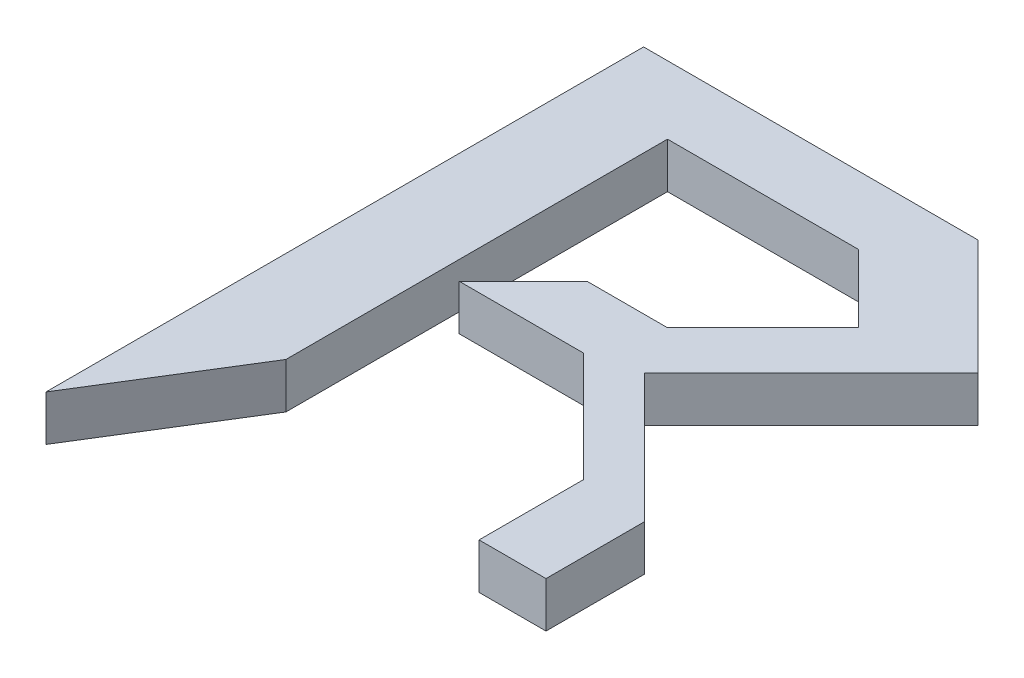
ISO-10303-21;
HEADER;
FILE_DESCRIPTION(('STEP AP214'),'2;1');
FILE_NAME('part.step','',(''),(''),'','','');
FILE_SCHEMA(('AUTOMOTIVE_DESIGN { 1 0 10303 214 1 1 1 1 }'));
ENDSEC;
DATA;
#1=APPLICATION_CONTEXT('core data for automotive mechanical design processes');
#2=APPLICATION_PROTOCOL_DEFINITION('international standard','automotive_design',2000,#1);
#3=PRODUCT_CONTEXT('',#1,'mechanical');
#4=PRODUCT('Part','Part','',(#3));
#5=PRODUCT_RELATED_PRODUCT_CATEGORY('part','',(#4));
#6=PRODUCT_DEFINITION_FORMATION('','',#4);
#7=PRODUCT_DEFINITION_CONTEXT('part definition',#1,'design');
#8=PRODUCT_DEFINITION('design','',#6,#7);
#9=PRODUCT_DEFINITION_SHAPE('','',#8);
#10=(LENGTH_UNIT() NAMED_UNIT(*) SI_UNIT(.MILLI.,.METRE.));
#11=(NAMED_UNIT(*) PLANE_ANGLE_UNIT() SI_UNIT($,.RADIAN.));
#12=(NAMED_UNIT(*) SI_UNIT($,.STERADIAN.) SOLID_ANGLE_UNIT());
#13=UNCERTAINTY_MEASURE_WITH_UNIT(LENGTH_MEASURE(1.E-05),#10,'distance_accuracy_value','');
#14=(GEOMETRIC_REPRESENTATION_CONTEXT(3) GLOBAL_UNCERTAINTY_ASSIGNED_CONTEXT((#13)) GLOBAL_UNIT_ASSIGNED_CONTEXT((#10,
#11,#12)) REPRESENTATION_CONTEXT('',''));
#15=CARTESIAN_POINT('',(0.,0.,0.));
#16=DIRECTION('',(0.,0.,1.));
#17=DIRECTION('',(1.,0.,0.));
#18=AXIS2_PLACEMENT_3D('',#15,#16,#17);
#19=CARTESIAN_POINT('',(-308.734454598416,5.,-184.527009345045));
#20=DIRECTION('',(0.,0.,1.));
#21=DIRECTION('',(1.,0.,0.));
#22=AXIS2_PLACEMENT_3D('',#19,#20,#21);
#23=PLANE('',#22);
#24=DIRECTION('',(-1.,0.,0.));
#25=VECTOR('',#24,1.);
#26=CARTESIAN_POINT('',(-308.734454598416,0.,-184.527009345045));
#27=LINE('',#26,#25);
#28=CARTESIAN_POINT('',(-308.734454598416,0.,-184.527009345045));
#29=VERTEX_POINT('',#28);
#30=CARTESIAN_POINT('',(-329.704801731719,0.,-184.527009345045));
#31=VERTEX_POINT('',#30);
#32=EDGE_CURVE('E184',#29,#31,#27,.T.);
#33=ORIENTED_EDGE('',*,*,#32,.F.);
#34=DIRECTION('',(0.,-1.,0.));
#35=VECTOR('',#34,1.);
#36=CARTESIAN_POINT('',(-308.734454598416,5.,-184.527009345045));
#37=LINE('',#36,#35);
#38=CARTESIAN_POINT('',(-308.734454598416,5.,-184.527009345045));
#39=VERTEX_POINT('',#38);
#40=EDGE_CURVE('E11',#39,#29,#37,.T.);
#41=ORIENTED_EDGE('',*,*,#40,.F.);
#42=DIRECTION('',(-1.,0.,0.));
#43=VECTOR('',#42,1.);
#44=CARTESIAN_POINT('',(-308.734454598416,5.,-184.527009345045));
#45=LINE('',#44,#43);
#46=CARTESIAN_POINT('',(-329.704801731719,5.,-184.527009345045));
#47=VERTEX_POINT('',#46);
#48=EDGE_CURVE('E231',#39,#47,#45,.T.);
#49=ORIENTED_EDGE('',*,*,#48,.T.);
#50=DIRECTION('',(0.,-1.,0.));
#51=VECTOR('',#50,1.);
#52=CARTESIAN_POINT('',(-329.704801731719,5.,-184.527009345045));
#53=LINE('',#52,#51);
#54=EDGE_CURVE('E36',#47,#31,#53,.T.);
#55=ORIENTED_EDGE('',*,*,#54,.T.);
#56=EDGE_LOOP('',(#33,#41,#49,#55));
#57=FACE_BOUND('',#56,.T.);
#58=ADVANCED_FACE('F33',(#57),#23,.T.);
#59=CARTESIAN_POINT('',(-301.268571849387,5.,-177.061126596016));
#60=DIRECTION('',(-0.70710678118654,0.,0.707106781186555));
#61=DIRECTION('',(0.707106781186555,0.,0.70710678118654));
#62=AXIS2_PLACEMENT_3D('',#59,#60,#61);
#63=PLANE('',#62);
#64=DIRECTION('',(-0.707106781186555,0.,-0.70710678118654));
#65=VECTOR('',#64,1.);
#66=CARTESIAN_POINT('',(-301.268571849387,0.,-177.061126596016));
#67=LINE('',#66,#65);
#68=CARTESIAN_POINT('',(-301.268571849387,0.,-177.061126596016));
#69=VERTEX_POINT('',#68);
#70=EDGE_CURVE('E229',#69,#29,#67,.T.);
#71=ORIENTED_EDGE('',*,*,#70,.F.);
#72=DIRECTION('',(0.,-1.,0.));
#73=VECTOR('',#72,1.);
#74=CARTESIAN_POINT('',(-301.268571849387,5.,-177.061126596016));
#75=LINE('',#74,#73);
#76=CARTESIAN_POINT('',(-301.268571849387,5.,-177.061126596016));
#77=VERTEX_POINT('',#76);
#78=EDGE_CURVE('E42',#77,#69,#75,.T.);
#79=ORIENTED_EDGE('',*,*,#78,.F.);
#80=DIRECTION('',(-0.707106781186555,0.,-0.70710678118654));
#81=VECTOR('',#80,1.);
#82=CARTESIAN_POINT('',(-301.268571849387,5.,-177.061126596016));
#83=LINE('',#82,#81);
#84=EDGE_CURVE('E174',#77,#39,#83,.T.);
#85=ORIENTED_EDGE('',*,*,#84,.T.);
#86=ORIENTED_EDGE('',*,*,#40,.T.);
#87=EDGE_LOOP('',(#71,#79,#85,#86));
#88=FACE_BOUND('',#87,.T.);
#89=ADVANCED_FACE('F261',(#88),#63,.T.);
#90=CARTESIAN_POINT('',(-311.753745416038,5.,-166.575953029364));
#91=DIRECTION('',(-0.707106781186556,0.,-0.707106781186539));
#92=DIRECTION('',(-0.707106781186539,0.,0.707106781186556));
#93=AXIS2_PLACEMENT_3D('',#90,#91,#92);
#94=PLANE('',#93);
#95=DIRECTION('',(0.707106781186539,0.,-0.707106781186556));
#96=VECTOR('',#95,1.);
#97=CARTESIAN_POINT('',(-311.753745416038,0.,-166.575953029364));
#98=LINE('',#97,#96);
#99=CARTESIAN_POINT('',(-311.753745416038,0.,-166.575953029364));
#100=VERTEX_POINT('',#99);
#101=EDGE_CURVE('E161',#100,#69,#98,.T.);
#102=ORIENTED_EDGE('',*,*,#101,.F.);
#103=DIRECTION('',(0.,-1.,0.));
#104=VECTOR('',#103,1.);
#105=CARTESIAN_POINT('',(-311.753745416038,5.,-166.575953029364));
#106=LINE('',#105,#104);
#107=CARTESIAN_POINT('',(-311.753745416038,5.,-166.575953029364));
#108=VERTEX_POINT('',#107);
#109=EDGE_CURVE('E156',#108,#100,#106,.T.);
#110=ORIENTED_EDGE('',*,*,#109,.F.);
#111=DIRECTION('',(0.707106781186539,0.,-0.707106781186556));
#112=VECTOR('',#111,1.);
#113=CARTESIAN_POINT('',(-311.753745416038,5.,-166.575953029364));
#114=LINE('',#113,#112);
#115=EDGE_CURVE('E159',#108,#77,#114,.T.);
#116=ORIENTED_EDGE('',*,*,#115,.T.);
#117=ORIENTED_EDGE('',*,*,#78,.T.);
#118=EDGE_LOOP('',(#102,#110,#116,#117));
#119=FACE_BOUND('',#118,.T.);
#120=ADVANCED_FACE('F158',(#119),#94,.T.);
#121=CARTESIAN_POINT('',(-320.592033082169,5.,-166.575953029364));
#122=DIRECTION('',(0.,0.,-1.));
#123=DIRECTION('',(-1.,0.,0.));
#124=AXIS2_PLACEMENT_3D('',#121,#122,#123);
#125=PLANE('',#124);
#126=DIRECTION('',(1.,0.,0.));
#127=VECTOR('',#126,1.);
#128=CARTESIAN_POINT('',(-320.592033082169,0.,-166.575953029364));
#129=LINE('',#128,#127);
#130=CARTESIAN_POINT('',(-320.592033082169,0.,-166.575953029364));
#131=VERTEX_POINT('',#130);
#132=EDGE_CURVE('E226',#131,#100,#129,.T.);
#133=ORIENTED_EDGE('',*,*,#132,.F.);
#134=DIRECTION('',(0.,-1.,0.));
#135=VECTOR('',#134,1.);
#136=CARTESIAN_POINT('',(-320.592033082169,5.,-166.575953029364));
#137=LINE('',#136,#135);
#138=CARTESIAN_POINT('',(-320.592033082169,5.,-166.575953029364));
#139=VERTEX_POINT('',#138);
#140=EDGE_CURVE('E166',#139,#131,#137,.T.);
#141=ORIENTED_EDGE('',*,*,#140,.F.);
#142=DIRECTION('',(1.,0.,0.));
#143=VECTOR('',#142,1.);
#144=CARTESIAN_POINT('',(-320.592033082169,5.,-166.575953029364));
#145=LINE('',#144,#143);
#146=EDGE_CURVE('E172',#139,#108,#145,.T.);
#147=ORIENTED_EDGE('',*,*,#146,.T.);
#148=ORIENTED_EDGE('',*,*,#109,.T.);
#149=EDGE_LOOP('',(#133,#141,#147,#148));
#150=FACE_BOUND('',#149,.T.);
#151=ADVANCED_FACE('F176',(#150),#125,.T.);
#152=CARTESIAN_POINT('',(-327.618746257726,5.,-159.549239853807));
#153=DIRECTION('',(-0.707106781186556,0.,-0.707106781186539));
#154=DIRECTION('',(-0.707106781186539,0.,0.707106781186556));
#155=AXIS2_PLACEMENT_3D('',#152,#153,#154);
#156=PLANE('',#155);
#157=DIRECTION('',(0.707106781186539,0.,-0.707106781186556));
#158=VECTOR('',#157,1.);
#159=CARTESIAN_POINT('',(-327.618746257726,0.,-159.549239853807));
#160=LINE('',#159,#158);
#161=CARTESIAN_POINT('',(-327.618746257726,0.,-159.549239853807));
#162=VERTEX_POINT('',#161);
#163=EDGE_CURVE('E223',#162,#131,#160,.T.);
#164=ORIENTED_EDGE('',*,*,#163,.F.);
#165=DIRECTION('',(0.,-1.,0.));
#166=VECTOR('',#165,1.);
#167=CARTESIAN_POINT('',(-327.618746257726,5.,-159.549239853807));
#168=LINE('',#167,#166);
#169=CARTESIAN_POINT('',(-327.618746257726,5.,-159.549239853807));
#170=VERTEX_POINT('',#169);
#171=EDGE_CURVE('E235',#170,#162,#168,.T.);
#172=ORIENTED_EDGE('',*,*,#171,.F.);
#173=DIRECTION('',(0.707106781186539,0.,-0.707106781186556));
#174=VECTOR('',#173,1.);
#175=CARTESIAN_POINT('',(-327.618746257726,5.,-159.549239853807));
#176=LINE('',#175,#174);
#177=EDGE_CURVE('E177',#170,#139,#176,.T.);
#178=ORIENTED_EDGE('',*,*,#177,.T.);
#179=ORIENTED_EDGE('',*,*,#140,.T.);
#180=EDGE_LOOP('',(#164,#172,#178,#179));
#181=FACE_BOUND('',#180,.T.);
#182=ADVANCED_FACE('F274',(#181),#156,.T.);
#183=CARTESIAN_POINT('',(-313.959793180223,5.,-159.549239853807));
#184=DIRECTION('',(0.,0.,1.));
#185=DIRECTION('',(1.,0.,0.));
#186=AXIS2_PLACEMENT_3D('',#183,#184,#185);
#187=PLANE('',#186);
#188=DIRECTION('',(-1.,0.,0.));
#189=VECTOR('',#188,1.);
#190=CARTESIAN_POINT('',(-313.959793180223,0.,-159.549239853807));
#191=LINE('',#190,#189);
#192=CARTESIAN_POINT('',(-313.959793180223,0.,-159.549239853807));
#193=VERTEX_POINT('',#192);
#194=EDGE_CURVE('E220',#193,#162,#191,.T.);
#195=ORIENTED_EDGE('',*,*,#194,.F.);
#196=DIRECTION('',(0.,-1.,0.));
#197=VECTOR('',#196,1.);
#198=CARTESIAN_POINT('',(-313.959793180223,5.,-159.549239853807));
#199=LINE('',#198,#197);
#200=CARTESIAN_POINT('',(-313.959793180223,5.,-159.549239853807));
#201=VERTEX_POINT('',#200);
#202=EDGE_CURVE('E237',#201,#193,#199,.T.);
#203=ORIENTED_EDGE('',*,*,#202,.F.);
#204=DIRECTION('',(-1.,0.,0.));
#205=VECTOR('',#204,1.);
#206=CARTESIAN_POINT('',(-313.959793180223,5.,-159.549239853807));
#207=LINE('',#206,#205);
#208=EDGE_CURVE('E179',#201,#170,#207,.T.);
#209=ORIENTED_EDGE('',*,*,#208,.T.);
#210=ORIENTED_EDGE('',*,*,#171,.T.);
#211=EDGE_LOOP('',(#195,#203,#209,#210));
#212=FACE_BOUND('',#211,.T.);
#213=ADVANCED_FACE('F277',(#212),#187,.T.);
#214=CARTESIAN_POINT('',(-301.910980799023,5.,-147.500427472607));
#215=DIRECTION('',(-0.707106781186539,0.,0.707106781186556));
#216=DIRECTION('',(0.707106781186556,0.,0.707106781186539));
#217=AXIS2_PLACEMENT_3D('',#214,#215,#216);
#218=PLANE('',#217);
#219=DIRECTION('',(-0.707106781186556,0.,-0.707106781186539));
#220=VECTOR('',#219,1.);
#221=CARTESIAN_POINT('',(-301.910980799023,0.,-147.500427472607));
#222=LINE('',#221,#220);
#223=CARTESIAN_POINT('',(-301.910980799023,0.,-147.500427472607));
#224=VERTEX_POINT('',#223);
#225=EDGE_CURVE('E217',#224,#193,#222,.T.);
#226=ORIENTED_EDGE('',*,*,#225,.F.);
#227=DIRECTION('',(0.,-1.,0.));
#228=VECTOR('',#227,1.);
#229=CARTESIAN_POINT('',(-301.910980799023,5.,-147.500427472607));
#230=LINE('',#229,#228);
#231=CARTESIAN_POINT('',(-301.910980799023,5.,-147.500427472607));
#232=VERTEX_POINT('',#231);
#233=EDGE_CURVE('E239',#232,#224,#230,.T.);
#234=ORIENTED_EDGE('',*,*,#233,.F.);
#235=DIRECTION('',(-0.707106781186556,0.,-0.707106781186539));
#236=VECTOR('',#235,1.);
#237=CARTESIAN_POINT('',(-301.910980799023,5.,-147.500427472607));
#238=LINE('',#237,#236);
#239=EDGE_CURVE('E475',#232,#201,#238,.T.);
#240=ORIENTED_EDGE('',*,*,#239,.T.);
#241=ORIENTED_EDGE('',*,*,#202,.T.);
#242=EDGE_LOOP('',(#226,#234,#240,#241));
#243=FACE_BOUND('',#242,.T.);
#244=ADVANCED_FACE('F281',(#243),#218,.T.);
#245=CARTESIAN_POINT('',(-301.910980799023,5.,-136.018956443195));
#246=DIRECTION('',(-1.,0.,0.));
#247=DIRECTION('',(0.,0.,1.));
#248=AXIS2_PLACEMENT_3D('',#245,#246,#247);
#249=PLANE('',#248);
#250=DIRECTION('',(0.,0.,-1.));
#251=VECTOR('',#250,1.);
#252=CARTESIAN_POINT('',(-301.910980799023,0.,-136.018956443195));
#253=LINE('',#252,#251);
#254=CARTESIAN_POINT('',(-301.910980799023,0.,-136.018956443195));
#255=VERTEX_POINT('',#254);
#256=EDGE_CURVE('E214',#255,#224,#253,.T.);
#257=ORIENTED_EDGE('',*,*,#256,.F.);
#258=DIRECTION('',(0.,-1.,0.));
#259=VECTOR('',#258,1.);
#260=CARTESIAN_POINT('',(-301.910980799023,5.,-136.018956443195));
#261=LINE('',#260,#259);
#262=CARTESIAN_POINT('',(-301.910980799023,5.,-136.018956443195));
#263=VERTEX_POINT('',#262);
#264=EDGE_CURVE('E241',#263,#255,#261,.T.);
#265=ORIENTED_EDGE('',*,*,#264,.F.);
#266=DIRECTION('',(0.,0.,-1.));
#267=VECTOR('',#266,1.);
#268=CARTESIAN_POINT('',(-301.910980799023,5.,-136.018956443195));
#269=LINE('',#268,#267);
#270=EDGE_CURVE('E468',#263,#232,#269,.T.);
#271=ORIENTED_EDGE('',*,*,#270,.T.);
#272=ORIENTED_EDGE('',*,*,#233,.T.);
#273=EDGE_LOOP('',(#257,#265,#271,#272));
#274=FACE_BOUND('',#273,.T.);
#275=ADVANCED_FACE('F285',(#274),#249,.T.);
#276=CARTESIAN_POINT('',(-294.55275173247,5.,-136.018956443195));
#277=DIRECTION('',(0.,0.,1.));
#278=DIRECTION('',(1.,0.,0.));
#279=AXIS2_PLACEMENT_3D('',#276,#277,#278);
#280=PLANE('',#279);
#281=DIRECTION('',(-1.,0.,0.));
#282=VECTOR('',#281,1.);
#283=CARTESIAN_POINT('',(-294.55275173247,0.,-136.018956443195));
#284=LINE('',#283,#282);
#285=CARTESIAN_POINT('',(-294.55275173247,0.,-136.018956443195));
#286=VERTEX_POINT('',#285);
#287=EDGE_CURVE('E211',#286,#255,#284,.T.);
#288=ORIENTED_EDGE('',*,*,#287,.F.);
#289=DIRECTION('',(0.,-1.,0.));
#290=VECTOR('',#289,1.);
#291=CARTESIAN_POINT('',(-294.55275173247,5.,-136.018956443195));
#292=LINE('',#291,#290);
#293=CARTESIAN_POINT('',(-294.55275173247,5.,-136.018956443195));
#294=VERTEX_POINT('',#293);
#295=EDGE_CURVE('E243',#294,#286,#292,.T.);
#296=ORIENTED_EDGE('',*,*,#295,.F.);
#297=DIRECTION('',(-1.,0.,0.));
#298=VECTOR('',#297,1.);
#299=CARTESIAN_POINT('',(-294.55275173247,5.,-136.018956443195));
#300=LINE('',#299,#298);
#301=EDGE_CURVE('E464',#294,#263,#300,.T.);
#302=ORIENTED_EDGE('',*,*,#301,.T.);
#303=ORIENTED_EDGE('',*,*,#264,.T.);
#304=EDGE_LOOP('',(#288,#296,#302,#303));
#305=FACE_BOUND('',#304,.T.);
#306=ADVANCED_FACE('F289',(#305),#280,.T.);
#307=CARTESIAN_POINT('',(-294.55275173247,5.,-146.837692944128));
#308=DIRECTION('',(1.,0.,0.));
#309=DIRECTION('',(0.,0.,-1.));
#310=AXIS2_PLACEMENT_3D('',#307,#308,#309);
#311=PLANE('',#310);
#312=DIRECTION('',(0.,0.,1.));
#313=VECTOR('',#312,1.);
#314=CARTESIAN_POINT('',(-294.55275173247,0.,-146.837692944128));
#315=LINE('',#314,#313);
#316=CARTESIAN_POINT('',(-294.55275173247,0.,-146.837692944128));
#317=VERTEX_POINT('',#316);
#318=EDGE_CURVE('E208',#317,#286,#315,.T.);
#319=ORIENTED_EDGE('',*,*,#318,.F.);
#320=DIRECTION('',(0.,-1.,0.));
#321=VECTOR('',#320,1.);
#322=CARTESIAN_POINT('',(-294.55275173247,5.,-146.837692944128));
#323=LINE('',#322,#321);
#324=CARTESIAN_POINT('',(-294.55275173247,5.,-146.837692944128));
#325=VERTEX_POINT('',#324);
#326=EDGE_CURVE('E245',#325,#317,#323,.T.);
#327=ORIENTED_EDGE('',*,*,#326,.F.);
#328=DIRECTION('',(0.,0.,1.));
#329=VECTOR('',#328,1.);
#330=CARTESIAN_POINT('',(-294.55275173247,5.,-146.837692944128));
#331=LINE('',#330,#329);
#332=EDGE_CURVE('E480',#325,#294,#331,.T.);
#333=ORIENTED_EDGE('',*,*,#332,.T.);
#334=ORIENTED_EDGE('',*,*,#295,.T.);
#335=EDGE_LOOP('',(#319,#327,#333,#334));
#336=FACE_BOUND('',#335,.T.);
#337=ADVANCED_FACE('F293',(#336),#311,.T.);
#338=CARTESIAN_POINT('',(-308.734522065012,5.,-161.01946327667));
#339=DIRECTION('',(0.707106781186539,0.,-0.707106781186557));
#340=DIRECTION('',(-0.707106781186557,0.,-0.707106781186539));
#341=AXIS2_PLACEMENT_3D('',#338,#339,#340);
#342=PLANE('',#341);
#343=DIRECTION('',(0.707106781186557,0.,0.707106781186539));
#344=VECTOR('',#343,1.);
#345=CARTESIAN_POINT('',(-308.734522065012,0.,-161.01946327667));
#346=LINE('',#345,#344);
#347=CARTESIAN_POINT('',(-308.734522065012,0.,-161.01946327667));
#348=VERTEX_POINT('',#347);
#349=EDGE_CURVE('E205',#348,#317,#346,.T.);
#350=ORIENTED_EDGE('',*,*,#349,.F.);
#351=DIRECTION('',(0.,-1.,0.));
#352=VECTOR('',#351,1.);
#353=CARTESIAN_POINT('',(-308.734522065012,5.,-161.01946327667));
#354=LINE('',#353,#352);
#355=CARTESIAN_POINT('',(-308.734522065012,5.,-161.01946327667));
#356=VERTEX_POINT('',#355);
#357=EDGE_CURVE('E247',#356,#348,#354,.T.);
#358=ORIENTED_EDGE('',*,*,#357,.F.);
#359=DIRECTION('',(0.707106781186557,0.,0.707106781186539));
#360=VECTOR('',#359,1.);
#361=CARTESIAN_POINT('',(-308.734522065012,5.,-161.01946327667));
#362=LINE('',#361,#360);
#363=EDGE_CURVE('E457',#356,#325,#362,.T.);
#364=ORIENTED_EDGE('',*,*,#363,.T.);
#365=ORIENTED_EDGE('',*,*,#326,.T.);
#366=EDGE_LOOP('',(#350,#358,#364,#365));
#367=FACE_BOUND('',#366,.T.);
#368=ADVANCED_FACE('F297',(#367),#342,.T.);
#369=CARTESIAN_POINT('',(-290.400599697601,5.,-179.35338564408));
#370=DIRECTION('',(0.707106781186548,0.,0.707106781186547));
#371=DIRECTION('',(0.707106781186547,0.,-0.707106781186548));
#372=AXIS2_PLACEMENT_3D('',#369,#370,#371);
#373=PLANE('',#372);
#374=DIRECTION('',(-0.707106781186547,0.,0.707106781186548));
#375=VECTOR('',#374,1.);
#376=CARTESIAN_POINT('',(-290.400599697601,0.,-179.35338564408));
#377=LINE('',#376,#375);
#378=CARTESIAN_POINT('',(-290.400599697601,0.,-179.35338564408));
#379=VERTEX_POINT('',#378);
#380=EDGE_CURVE('E202',#379,#348,#377,.T.);
#381=ORIENTED_EDGE('',*,*,#380,.F.);
#382=DIRECTION('',(0.,-1.,0.));
#383=VECTOR('',#382,1.);
#384=CARTESIAN_POINT('',(-290.400599697601,5.,-179.35338564408));
#385=LINE('',#384,#383);
#386=CARTESIAN_POINT('',(-290.400599697601,5.,-179.35338564408));
#387=VERTEX_POINT('',#386);
#388=EDGE_CURVE('E249',#387,#379,#385,.T.);
#389=ORIENTED_EDGE('',*,*,#388,.F.);
#390=DIRECTION('',(-0.707106781186547,0.,0.707106781186548));
#391=VECTOR('',#390,1.);
#392=CARTESIAN_POINT('',(-290.400599697601,5.,-179.35338564408));
#393=LINE('',#392,#391);
#394=EDGE_CURVE('E453',#387,#356,#393,.T.);
#395=ORIENTED_EDGE('',*,*,#394,.T.);
#396=ORIENTED_EDGE('',*,*,#357,.T.);
#397=EDGE_LOOP('',(#381,#389,#395,#396));
#398=FACE_BOUND('',#397,.T.);
#399=ADVANCED_FACE('F301',(#398),#373,.T.);
#400=CARTESIAN_POINT('',(-303.040106147596,5.,-191.992892094075));
#401=DIRECTION('',(0.70710678118654,0.,-0.707106781186555));
#402=DIRECTION('',(-0.707106781186555,0.,-0.70710678118654));
#403=AXIS2_PLACEMENT_3D('',#400,#401,#402);
#404=PLANE('',#403);
#405=DIRECTION('',(0.707106781186555,0.,0.70710678118654));
#406=VECTOR('',#405,1.);
#407=CARTESIAN_POINT('',(-303.040106147596,0.,-191.992892094075));
#408=LINE('',#407,#406);
#409=CARTESIAN_POINT('',(-303.040106147596,0.,-191.992892094075));
#410=VERTEX_POINT('',#409);
#411=EDGE_CURVE('E199',#410,#379,#408,.T.);
#412=ORIENTED_EDGE('',*,*,#411,.F.);
#413=DIRECTION('',(0.,-1.,0.));
#414=VECTOR('',#413,1.);
#415=CARTESIAN_POINT('',(-303.040106147596,5.,-191.992892094075));
#416=LINE('',#415,#414);
#417=CARTESIAN_POINT('',(-303.040106147596,5.,-191.992892094075));
#418=VERTEX_POINT('',#417);
#419=EDGE_CURVE('E251',#418,#410,#416,.T.);
#420=ORIENTED_EDGE('',*,*,#419,.F.);
#421=DIRECTION('',(0.707106781186555,0.,0.70710678118654));
#422=VECTOR('',#421,1.);
#423=CARTESIAN_POINT('',(-303.040106147596,5.,-191.992892094075));
#424=LINE('',#423,#422);
#425=EDGE_CURVE('E484',#418,#387,#424,.T.);
#426=ORIENTED_EDGE('',*,*,#425,.T.);
#427=ORIENTED_EDGE('',*,*,#388,.T.);
#428=EDGE_LOOP('',(#412,#420,#426,#427));
#429=FACE_BOUND('',#428,.T.);
#430=ADVANCED_FACE('F305',(#429),#404,.T.);
#431=CARTESIAN_POINT('',(-339.799413005988,5.,-191.992892094075));
#432=DIRECTION('',(0.,0.,-1.));
#433=DIRECTION('',(-1.,0.,0.));
#434=AXIS2_PLACEMENT_3D('',#431,#432,#433);
#435=PLANE('',#434);
#436=DIRECTION('',(1.,0.,0.));
#437=VECTOR('',#436,1.);
#438=CARTESIAN_POINT('',(-339.799413005988,0.,-191.992892094075));
#439=LINE('',#438,#437);
#440=CARTESIAN_POINT('',(-339.799413005988,0.,-191.992892094075));
#441=VERTEX_POINT('',#440);
#442=EDGE_CURVE('E196',#441,#410,#439,.T.);
#443=ORIENTED_EDGE('',*,*,#442,.F.);
#444=DIRECTION('',(0.,-1.,0.));
#445=VECTOR('',#444,1.);
#446=CARTESIAN_POINT('',(-339.799413005988,5.,-191.992892094075));
#447=LINE('',#446,#445);
#448=CARTESIAN_POINT('',(-339.799413005988,5.,-191.992892094075));
#449=VERTEX_POINT('',#448);
#450=EDGE_CURVE('E253',#449,#441,#447,.T.);
#451=ORIENTED_EDGE('',*,*,#450,.F.);
#452=DIRECTION('',(1.,0.,0.));
#453=VECTOR('',#452,1.);
#454=CARTESIAN_POINT('',(-339.799413005988,5.,-191.992892094075));
#455=LINE('',#454,#453);
#456=EDGE_CURVE('E446',#449,#418,#455,.T.);
#457=ORIENTED_EDGE('',*,*,#456,.T.);
#458=ORIENTED_EDGE('',*,*,#419,.T.);
#459=EDGE_LOOP('',(#443,#451,#457,#458));
#460=FACE_BOUND('',#459,.T.);
#461=ADVANCED_FACE('F309',(#460),#435,.T.);
#462=CARTESIAN_POINT('',(-339.799413005988,5.,-126.304683990909));
#463=DIRECTION('',(-1.,0.,0.));
#464=DIRECTION('',(0.,0.,1.));
#465=AXIS2_PLACEMENT_3D('',#462,#463,#464);
#466=PLANE('',#465);
#467=DIRECTION('',(0.,0.,-1.));
#468=VECTOR('',#467,1.);
#469=CARTESIAN_POINT('',(-339.799413005988,0.,-126.304683990909));
#470=LINE('',#469,#468);
#471=CARTESIAN_POINT('',(-339.799413005988,0.,-126.304683990909));
#472=VERTEX_POINT('',#471);
#473=EDGE_CURVE('E193',#472,#441,#470,.T.);
#474=ORIENTED_EDGE('',*,*,#473,.F.);
#475=DIRECTION('',(0.,-1.,0.));
#476=VECTOR('',#475,1.);
#477=CARTESIAN_POINT('',(-339.799413005988,5.,-126.304683990909));
#478=LINE('',#477,#476);
#479=CARTESIAN_POINT('',(-339.799413005988,5.,-126.304683990909));
#480=VERTEX_POINT('',#479);
#481=EDGE_CURVE('E255',#480,#472,#478,.T.);
#482=ORIENTED_EDGE('',*,*,#481,.F.);
#483=DIRECTION('',(0.,0.,-1.));
#484=VECTOR('',#483,1.);
#485=CARTESIAN_POINT('',(-339.799413005988,5.,-126.304683990909));
#486=LINE('',#485,#484);
#487=EDGE_CURVE('E442',#480,#449,#486,.T.);
#488=ORIENTED_EDGE('',*,*,#487,.T.);
#489=ORIENTED_EDGE('',*,*,#450,.T.);
#490=EDGE_LOOP('',(#474,#482,#488,#489));
#491=FACE_BOUND('',#490,.T.);
#492=ADVANCED_FACE('F313',(#491),#466,.T.);
#493=CARTESIAN_POINT('',(-329.704801731719,5.,-142.586315078439));
#494=DIRECTION('',(0.849902691712378,0.,0.526939668861678));
#495=DIRECTION('',(0.526939668861678,0.,-0.849902691712378));
#496=AXIS2_PLACEMENT_3D('',#493,#494,#495);
#497=PLANE('',#496);
#498=DIRECTION('',(-0.526939668861678,0.,0.849902691712378));
#499=VECTOR('',#498,1.);
#500=CARTESIAN_POINT('',(-329.704801731719,0.,-142.586315078439));
#501=LINE('',#500,#499);
#502=CARTESIAN_POINT('',(-329.704801731719,0.,-142.586315078439));
#503=VERTEX_POINT('',#502);
#504=EDGE_CURVE('E190',#503,#472,#501,.T.);
#505=ORIENTED_EDGE('',*,*,#504,.F.);
#506=DIRECTION('',(0.,-1.,0.));
#507=VECTOR('',#506,1.);
#508=CARTESIAN_POINT('',(-329.704801731719,5.,-142.586315078439));
#509=LINE('',#508,#507);
#510=CARTESIAN_POINT('',(-329.704801731719,5.,-142.586315078439));
#511=VERTEX_POINT('',#510);
#512=EDGE_CURVE('E256',#511,#503,#509,.T.);
#513=ORIENTED_EDGE('',*,*,#512,.F.);
#514=DIRECTION('',(-0.526939668861678,0.,0.849902691712378));
#515=VECTOR('',#514,1.);
#516=CARTESIAN_POINT('',(-329.704801731719,5.,-142.586315078439));
#517=LINE('',#516,#515);
#518=EDGE_CURVE('E488',#511,#480,#517,.T.);
#519=ORIENTED_EDGE('',*,*,#518,.T.);
#520=ORIENTED_EDGE('',*,*,#481,.T.);
#521=EDGE_LOOP('',(#505,#513,#519,#520));
#522=FACE_BOUND('',#521,.T.);
#523=ADVANCED_FACE('F317',(#522),#497,.T.);
#524=CARTESIAN_POINT('',(-329.704801731719,5.,-184.527009345045));
#525=DIRECTION('',(1.,0.,0.));
#526=DIRECTION('',(0.,0.,-1.));
#527=AXIS2_PLACEMENT_3D('',#524,#525,#526);
#528=PLANE('',#527);
#529=DIRECTION('',(0.,0.,1.));
#530=VECTOR('',#529,1.);
#531=CARTESIAN_POINT('',(-329.704801731719,0.,-184.527009345045));
#532=LINE('',#531,#530);
#533=EDGE_CURVE('E187',#31,#503,#532,.T.);
#534=ORIENTED_EDGE('',*,*,#533,.F.);
#535=ORIENTED_EDGE('',*,*,#54,.F.);
#536=DIRECTION('',(0.,0.,1.));
#537=VECTOR('',#536,1.);
#538=CARTESIAN_POINT('',(-329.704801731719,5.,-184.527009345045));
#539=LINE('',#538,#537);
#540=EDGE_CURVE('E490',#47,#511,#539,.T.);
#541=ORIENTED_EDGE('',*,*,#540,.T.);
#542=ORIENTED_EDGE('',*,*,#512,.T.);
#543=EDGE_LOOP('',(#534,#535,#541,#542));
#544=FACE_BOUND('',#543,.T.);
#545=ADVANCED_FACE('F258',(#544),#528,.T.);
#546=CARTESIAN_POINT('',(0.,5.,0.));
#547=DIRECTION('',(0.,1.,0.));
#548=DIRECTION('',(0.,0.,1.));
#549=AXIS2_PLACEMENT_3D('',#546,#547,#548);
#550=PLANE('',#549);
#551=ORIENTED_EDGE('',*,*,#48,.F.);
#552=ORIENTED_EDGE('',*,*,#84,.F.);
#553=ORIENTED_EDGE('',*,*,#115,.F.);
#554=ORIENTED_EDGE('',*,*,#146,.F.);
#555=ORIENTED_EDGE('',*,*,#177,.F.);
#556=ORIENTED_EDGE('',*,*,#208,.F.);
#557=ORIENTED_EDGE('',*,*,#239,.F.);
#558=ORIENTED_EDGE('',*,*,#270,.F.);
#559=ORIENTED_EDGE('',*,*,#301,.F.);
#560=ORIENTED_EDGE('',*,*,#332,.F.);
#561=ORIENTED_EDGE('',*,*,#363,.F.);
#562=ORIENTED_EDGE('',*,*,#394,.F.);
#563=ORIENTED_EDGE('',*,*,#425,.F.);
#564=ORIENTED_EDGE('',*,*,#456,.F.);
#565=ORIENTED_EDGE('',*,*,#487,.F.);
#566=ORIENTED_EDGE('',*,*,#518,.F.);
#567=ORIENTED_EDGE('',*,*,#540,.F.);
#568=EDGE_LOOP('',(#551,#552,#553,#554,#555,#556,#557,#558,#559,#560,#561,#562,#563,#564,#565,
#566,#567));
#569=FACE_BOUND('',#568,.T.);
#570=ADVANCED_FACE('F170',(#569),#550,.T.);
#571=CARTESIAN_POINT('',(0.,0.,0.));
#572=DIRECTION('',(0.,1.,0.));
#573=DIRECTION('',(0.,0.,1.));
#574=AXIS2_PLACEMENT_3D('',#571,#572,#573);
#575=PLANE('',#574);
#576=ORIENTED_EDGE('',*,*,#32,.T.);
#577=ORIENTED_EDGE('',*,*,#533,.T.);
#578=ORIENTED_EDGE('',*,*,#504,.T.);
#579=ORIENTED_EDGE('',*,*,#473,.T.);
#580=ORIENTED_EDGE('',*,*,#442,.T.);
#581=ORIENTED_EDGE('',*,*,#411,.T.);
#582=ORIENTED_EDGE('',*,*,#380,.T.);
#583=ORIENTED_EDGE('',*,*,#349,.T.);
#584=ORIENTED_EDGE('',*,*,#318,.T.);
#585=ORIENTED_EDGE('',*,*,#287,.T.);
#586=ORIENTED_EDGE('',*,*,#256,.T.);
#587=ORIENTED_EDGE('',*,*,#225,.T.);
#588=ORIENTED_EDGE('',*,*,#194,.T.);
#589=ORIENTED_EDGE('',*,*,#163,.T.);
#590=ORIENTED_EDGE('',*,*,#132,.T.);
#591=ORIENTED_EDGE('',*,*,#101,.T.);
#592=ORIENTED_EDGE('',*,*,#70,.T.);
#593=EDGE_LOOP('',(#576,#577,#578,#579,#580,#581,#582,#583,#584,#585,#586,#587,#588,#589,#590,
#591,#592));
#594=FACE_BOUND('',#593,.T.);
#595=ADVANCED_FACE('F260',(#594),#575,.F.);
#596=CLOSED_SHELL('',(#58,#89,#120,#151,#182,#213,#244,#275,#306,#337,#368,#399,#430,#461,#492,
#523,#545,#570,#595));
#597=MANIFOLD_SOLID_BREP('B2',#596);
#598=ADVANCED_BREP_SHAPE_REPRESENTATION('',(#18,#597),#14);
#599=SHAPE_DEFINITION_REPRESENTATION(#9,#598);
ENDSEC;
END-ISO-10303-21;
